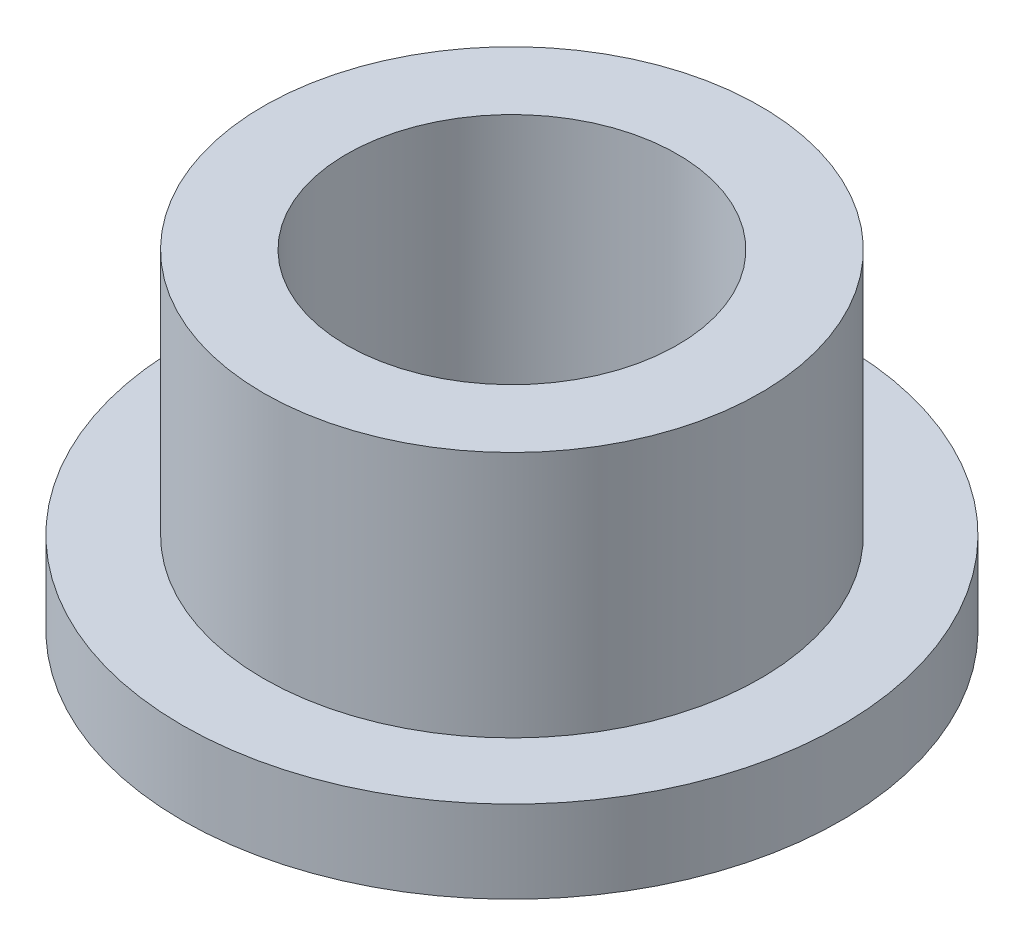
ISO-10303-21;
HEADER;
FILE_DESCRIPTION(('STEP AP214'),'2;1');
FILE_NAME('part.step','',(''),(''),'','','');
FILE_SCHEMA(('AUTOMOTIVE_DESIGN { 1 0 10303 214 1 1 1 1 }'));
ENDSEC;
DATA;
#1=APPLICATION_CONTEXT('core data for automotive mechanical design processes');
#2=APPLICATION_PROTOCOL_DEFINITION('international standard','automotive_design',2000,#1);
#3=PRODUCT_CONTEXT('',#1,'mechanical');
#4=PRODUCT('Part','Part','',(#3));
#5=PRODUCT_RELATED_PRODUCT_CATEGORY('part','',(#4));
#6=PRODUCT_DEFINITION_FORMATION('','',#4);
#7=PRODUCT_DEFINITION_CONTEXT('part definition',#1,'design');
#8=PRODUCT_DEFINITION('design','',#6,#7);
#9=PRODUCT_DEFINITION_SHAPE('','',#8);
#10=(LENGTH_UNIT() NAMED_UNIT(*) SI_UNIT(.MILLI.,.METRE.));
#11=(NAMED_UNIT(*) PLANE_ANGLE_UNIT() SI_UNIT($,.RADIAN.));
#12=(NAMED_UNIT(*) SI_UNIT($,.STERADIAN.) SOLID_ANGLE_UNIT());
#13=UNCERTAINTY_MEASURE_WITH_UNIT(LENGTH_MEASURE(1.E-05),#10,'distance_accuracy_value','');
#14=(GEOMETRIC_REPRESENTATION_CONTEXT(3) GLOBAL_UNCERTAINTY_ASSIGNED_CONTEXT((#13)) GLOBAL_UNIT_ASSIGNED_CONTEXT((#10,
#11,#12)) REPRESENTATION_CONTEXT('',''));
#15=CARTESIAN_POINT('',(0.,0.,0.));
#16=DIRECTION('',(0.,0.,1.));
#17=DIRECTION('',(1.,0.,0.));
#18=AXIS2_PLACEMENT_3D('',#15,#16,#17);
#19=CARTESIAN_POINT('',(0.,6.35,0.));
#20=DIRECTION('',(0.,1.,0.));
#21=DIRECTION('',(0.,0.,1.));
#22=AXIS2_PLACEMENT_3D('',#19,#20,#21);
#23=PLANE('',#22);
#24=CARTESIAN_POINT('',(0.,6.35,0.));
#25=DIRECTION('',(0.,1.,0.));
#26=DIRECTION('',(0.,0.,1.));
#27=AXIS2_PLACEMENT_3D('',#24,#25,#26);
#28=CIRCLE('',#27,4.7879);
#29=CARTESIAN_POINT('',(0.,6.35,4.7879));
#30=VERTEX_POINT('',#29);
#31=EDGE_CURVE('E10',#30,#30,#28,.T.);
#32=ORIENTED_EDGE('',*,*,#31,.T.);
#33=EDGE_LOOP('',(#32));
#34=FACE_BOUND('',#33,.T.);
#35=CARTESIAN_POINT('',(0.,6.35,0.));
#36=DIRECTION('',(0.,1.,0.));
#37=DIRECTION('',(0.,0.,1.));
#38=AXIS2_PLACEMENT_3D('',#35,#36,#37);
#39=CIRCLE('',#38,3.1877);
#40=CARTESIAN_POINT('',(0.,6.35,3.1877));
#41=VERTEX_POINT('',#40);
#42=EDGE_CURVE('E38',#41,#41,#39,.T.);
#43=ORIENTED_EDGE('',*,*,#42,.F.);
#44=EDGE_LOOP('',(#43));
#45=FACE_BOUND('',#44,.T.);
#46=ADVANCED_FACE('F31',(#34,#45),#23,.T.);
#47=CARTESIAN_POINT('',(0.,0.,0.));
#48=DIRECTION('',(0.,1.,0.));
#49=DIRECTION('',(0.,0.,1.));
#50=AXIS2_PLACEMENT_3D('',#47,#48,#49);
#51=PLANE('',#50);
#52=CARTESIAN_POINT('',(0.,0.,0.));
#53=DIRECTION('',(0.,1.,0.));
#54=DIRECTION('',(0.,0.,1.));
#55=AXIS2_PLACEMENT_3D('',#52,#53,#54);
#56=CIRCLE('',#55,3.1877);
#57=CARTESIAN_POINT('',(0.,0.,3.1877));
#58=VERTEX_POINT('',#57);
#59=EDGE_CURVE('E42',#58,#58,#56,.T.);
#60=ORIENTED_EDGE('',*,*,#59,.T.);
#61=EDGE_LOOP('',(#60));
#62=FACE_BOUND('',#61,.T.);
#63=CARTESIAN_POINT('',(0.,0.,0.));
#64=DIRECTION('',(0.,1.,0.));
#65=DIRECTION('',(0.,0.,1.));
#66=AXIS2_PLACEMENT_3D('',#63,#64,#65);
#67=CIRCLE('',#66,6.35);
#68=CARTESIAN_POINT('',(0.,0.,6.35));
#69=VERTEX_POINT('',#68);
#70=EDGE_CURVE('E49',#69,#69,#67,.T.);
#71=ORIENTED_EDGE('',*,*,#70,.F.);
#72=EDGE_LOOP('',(#71));
#73=FACE_BOUND('',#72,.T.);
#74=ADVANCED_FACE('F74',(#62,#73),#51,.F.);
#75=CARTESIAN_POINT('',(0.,6.35,0.));
#76=DIRECTION('',(0.,-1.,0.));
#77=DIRECTION('',(0.,0.,-1.));
#78=AXIS2_PLACEMENT_3D('',#75,#76,#77);
#79=CYLINDRICAL_SURFACE('',#78,4.7879);
#80=CARTESIAN_POINT('',(0.,1.5875,0.));
#81=DIRECTION('',(0.,1.,0.));
#82=DIRECTION('',(0.,0.,1.));
#83=AXIS2_PLACEMENT_3D('',#80,#81,#82);
#84=CIRCLE('',#83,4.7879);
#85=CARTESIAN_POINT('',(0.,1.5875,4.7879));
#86=VERTEX_POINT('',#85);
#87=EDGE_CURVE('E52',#86,#86,#84,.T.);
#88=ORIENTED_EDGE('',*,*,#87,.T.);
#89=EDGE_LOOP('',(#88));
#90=FACE_BOUND('',#89,.T.);
#91=ORIENTED_EDGE('',*,*,#31,.F.);
#92=EDGE_LOOP('',(#91));
#93=FACE_BOUND('',#92,.T.);
#94=ADVANCED_FACE('F33',(#90,#93),#79,.T.);
#95=CARTESIAN_POINT('',(0.,6.35,0.));
#96=DIRECTION('',(0.,-1.,0.));
#97=DIRECTION('',(0.,0.,-1.));
#98=AXIS2_PLACEMENT_3D('',#95,#96,#97);
#99=CYLINDRICAL_SURFACE('',#98,3.1877);
#100=ORIENTED_EDGE('',*,*,#42,.T.);
#101=EDGE_LOOP('',(#100));
#102=FACE_BOUND('',#101,.T.);
#103=ORIENTED_EDGE('',*,*,#59,.F.);
#104=EDGE_LOOP('',(#103));
#105=FACE_BOUND('',#104,.T.);
#106=ADVANCED_FACE('F63',(#102,#105),#99,.F.);
#107=CARTESIAN_POINT('',(0.,1.5875,0.));
#108=DIRECTION('',(0.,1.,0.));
#109=DIRECTION('',(0.,0.,1.));
#110=AXIS2_PLACEMENT_3D('',#107,#108,#109);
#111=PLANE('',#110);
#112=CARTESIAN_POINT('',(0.,1.5875,0.));
#113=DIRECTION('',(0.,1.,0.));
#114=DIRECTION('',(0.,0.,1.));
#115=AXIS2_PLACEMENT_3D('',#112,#113,#114);
#116=CIRCLE('',#115,6.35);
#117=CARTESIAN_POINT('',(0.,1.5875,6.35));
#118=VERTEX_POINT('',#117);
#119=EDGE_CURVE('E47',#118,#118,#116,.T.);
#120=ORIENTED_EDGE('',*,*,#119,.T.);
#121=EDGE_LOOP('',(#120));
#122=FACE_BOUND('',#121,.T.);
#123=ORIENTED_EDGE('',*,*,#87,.F.);
#124=EDGE_LOOP('',(#123));
#125=FACE_BOUND('',#124,.T.);
#126=ADVANCED_FACE('F60',(#122,#125),#111,.T.);
#127=CARTESIAN_POINT('',(0.,1.5875,0.));
#128=DIRECTION('',(0.,-1.,0.));
#129=DIRECTION('',(0.,0.,-1.));
#130=AXIS2_PLACEMENT_3D('',#127,#128,#129);
#131=CYLINDRICAL_SURFACE('',#130,6.35);
#132=ORIENTED_EDGE('',*,*,#119,.F.);
#133=EDGE_LOOP('',(#132));
#134=FACE_BOUND('',#133,.T.);
#135=ORIENTED_EDGE('',*,*,#70,.T.);
#136=EDGE_LOOP('',(#135));
#137=FACE_BOUND('',#136,.T.);
#138=ADVANCED_FACE('F62',(#134,#137),#131,.T.);
#139=CLOSED_SHELL('',(#46,#74,#94,#106,#126,#138));
#140=MANIFOLD_SOLID_BREP('B2',#139);
#141=ADVANCED_BREP_SHAPE_REPRESENTATION('',(#18,#140),#14);
#142=SHAPE_DEFINITION_REPRESENTATION(#9,#141);
ENDSEC;
END-ISO-10303-21;
